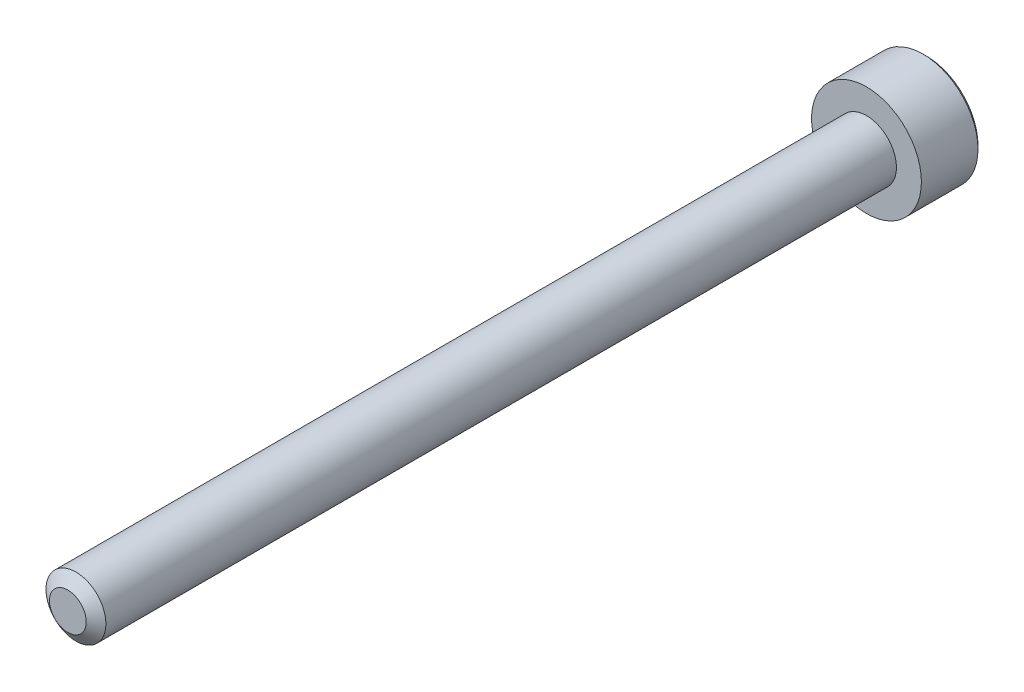
ISO-10303-21;
HEADER;
FILE_DESCRIPTION(('STEP AP214'),'2;1');
FILE_NAME('part.step','',(''),(''),'','','');
FILE_SCHEMA(('AUTOMOTIVE_DESIGN { 1 0 10303 214 1 1 1 1 }'));
ENDSEC;
DATA;
#1=APPLICATION_CONTEXT('core data for automotive mechanical design processes');
#2=APPLICATION_PROTOCOL_DEFINITION('international standard','automotive_design',2000,#1);
#3=PRODUCT_CONTEXT('',#1,'mechanical');
#4=PRODUCT('Part','Part','',(#3));
#5=PRODUCT_RELATED_PRODUCT_CATEGORY('part','',(#4));
#6=PRODUCT_DEFINITION_FORMATION('','',#4);
#7=PRODUCT_DEFINITION_CONTEXT('part definition',#1,'design');
#8=PRODUCT_DEFINITION('design','',#6,#7);
#9=PRODUCT_DEFINITION_SHAPE('','',#8);
#10=(LENGTH_UNIT() NAMED_UNIT(*) SI_UNIT(.MILLI.,.METRE.));
#11=(NAMED_UNIT(*) PLANE_ANGLE_UNIT() SI_UNIT($,.RADIAN.));
#12=(NAMED_UNIT(*) SI_UNIT($,.STERADIAN.) SOLID_ANGLE_UNIT());
#13=UNCERTAINTY_MEASURE_WITH_UNIT(LENGTH_MEASURE(1.E-05),#10,'distance_accuracy_value','');
#14=(GEOMETRIC_REPRESENTATION_CONTEXT(3) GLOBAL_UNCERTAINTY_ASSIGNED_CONTEXT((#13)) GLOBAL_UNIT_ASSIGNED_CONTEXT((#10,
#11,#12)) REPRESENTATION_CONTEXT('',''));
#15=CARTESIAN_POINT('',(0.,0.,0.));
#16=DIRECTION('',(0.,0.,1.));
#17=DIRECTION('',(1.,0.,0.));
#18=AXIS2_PLACEMENT_3D('',#15,#16,#17);
#19=CARTESIAN_POINT('',(0.,-1.44337567297406,-41.125));
#20=DIRECTION('',(-0.5,-0.866025403784439,0.));
#21=DIRECTION('',(0.866025403784439,-0.5,0.));
#22=AXIS2_PLACEMENT_3D('',#19,#20,#21);
#23=PLANE('',#22);
#24=CARTESIAN_POINT('',(-1.24999999999963,-0.721687836487239,-43.000000000003));
#25=CARTESIAN_POINT('',(-1.20703689149564,-0.746492598747242,-42.975219039721));
#26=CARTESIAN_POINT('',(-1.16335543595403,-0.771712098862788,-42.9518937494657));
#27=CARTESIAN_POINT('',(-1.07428446543638,-0.823137247668132,-42.909186138913));
#28=CARTESIAN_POINT('',(-1.02888648443507,-0.849347784219903,-42.8898275733521));
#29=CARTESIAN_POINT('',(-0.937343688522239,-0.902200042082549,-42.856666215906));
#30=CARTESIAN_POINT('',(-0.891222174141857,-0.928828310825495,-42.8427800967764));
#31=CARTESIAN_POINT('',(-0.797964038891722,-0.982670920316284,-42.8213859017929));
#32=CARTESIAN_POINT('',(-0.750830264934014,-1.00988361739869,-42.8138618619147));
#33=CARTESIAN_POINT('',(-0.669590913522165,-1.05678717880511,-42.8070728277893));
#34=CARTESIAN_POINT('',(-0.635590177984719,-1.0764175126203,-42.8060681886478));
#35=CARTESIAN_POINT('',(-0.567648554675726,-1.11564362712693,-42.8077634952143));
#36=CARTESIAN_POINT('',(-0.533707681782475,-1.13523939922838,-42.8104642592547));
#37=CARTESIAN_POINT('',(-0.466153619735967,-1.17424175513578,-42.819414248338));
#38=CARTESIAN_POINT('',(-0.432540764897634,-1.19364814592492,-42.8256667730503));
#39=CARTESIAN_POINT('',(-0.365876260757905,-1.23213691533539,-42.8413835392386));
#40=CARTESIAN_POINT('',(-0.332824858668716,-1.25121915122868,-42.8508491588515));
#41=CARTESIAN_POINT('',(-0.248213569935874,-1.30006950155507,-42.8789283315731));
#42=CARTESIAN_POINT('',(-0.197186124431756,-1.32953021095293,-42.8996493450566));
#43=CARTESIAN_POINT('',(-0.0971276056215303,-1.38729902372273,-42.9463235058126));
#44=CARTESIAN_POINT('',(-0.0480906425376808,-1.41561052755943,-42.9722596212246));
#45=CARTESIAN_POINT('',(-3.61828884321874E-13,-1.44337567297385,-43.000000000003));
#46=B_SPLINE_CURVE_WITH_KNOTS('',3,(#24,#25,#26,#27,#28,#29,#30,#31,#32,#33,#34,#35,#36,#37,#38,
#39,#40,#41,#42,#43,#44,#45),.UNSPECIFIED.,.F.,.F.,(4,2,2,2,2,2,2,2,2,2,4),(0.,0.16647868322575,
0.333926926832641,0.498716658518154,0.663091654628168,0.780745575560145,0.898425484353181,
1.01621489977196,1.13405490052613,1.32111591641517,1.50757565758526),.UNSPECIFIED.);
#47=CARTESIAN_POINT('',(-1.25000000000258,-0.721687836485538,-43.0000000000047));
#48=VERTEX_POINT('',#47);
#49=CARTESIAN_POINT('',(-2.76064978169122E-12,-1.44337567297566,-43.0000000000048));
#50=VERTEX_POINT('',#49);
#51=EDGE_CURVE('E21',#48,#50,#46,.T.);
#52=ORIENTED_EDGE('',*,*,#51,.F.);
#53=DIRECTION('',(0.,0.,1.));
#54=VECTOR('',#53,1.);
#55=CARTESIAN_POINT('',(-1.25,-0.721687836487032,-41.125));
#56=LINE('',#55,#54);
#57=CARTESIAN_POINT('',(-1.25,-0.721687836487031,-41.125));
#58=VERTEX_POINT('',#57);
#59=EDGE_CURVE('E104',#48,#58,#56,.T.);
#60=ORIENTED_EDGE('',*,*,#59,.T.);
#61=DIRECTION('',(0.866025403784439,-0.5,0.));
#62=VECTOR('',#61,1.);
#63=CARTESIAN_POINT('',(0.,-1.44337567297406,-41.125));
#64=LINE('',#63,#62);
#65=CARTESIAN_POINT('',(0.,-1.44337567297406,-41.125));
#66=VERTEX_POINT('',#65);
#67=EDGE_CURVE('E77',#66,#58,#64,.F.);
#68=ORIENTED_EDGE('',*,*,#67,.F.);
#69=DIRECTION('',(0.,0.,1.));
#70=VECTOR('',#69,1.);
#71=CARTESIAN_POINT('',(0.,-1.44337567297406,-41.125));
#72=LINE('',#71,#70);
#73=EDGE_CURVE('E76',#66,#50,#72,.F.);
#74=ORIENTED_EDGE('',*,*,#73,.T.);
#75=EDGE_LOOP('',(#52,#60,#68,#74));
#76=FACE_BOUND('',#75,.T.);
#77=ADVANCED_FACE('F17',(#76),#23,.F.);
#78=CARTESIAN_POINT('',(1.25,-0.721687836487033,-41.125));
#79=DIRECTION('',(0.5,-0.866025403784439,0.));
#80=DIRECTION('',(0.866025403784439,0.5,0.));
#81=AXIS2_PLACEMENT_3D('',#78,#79,#80);
#82=PLANE('',#81);
#83=CARTESIAN_POINT('',(3.65491355903534E-13,-1.44337567297385,-43.000000000003));
#84=CARTESIAN_POINT('',(0.042963108504357,-1.41857091071385,-42.975219039721));
#85=CARTESIAN_POINT('',(0.0866445640459731,-1.3933514105983,-42.9518937494657));
#86=CARTESIAN_POINT('',(0.175715534563619,-1.34192626179296,-42.909186138913));
#87=CARTESIAN_POINT('',(0.221113515564926,-1.31571572524119,-42.8898275733521));
#88=CARTESIAN_POINT('',(0.312656311477759,-1.26286346737855,-42.856666215906));
#89=CARTESIAN_POINT('',(0.35877782585814,-1.2362351986356,-42.8427800967764));
#90=CARTESIAN_POINT('',(0.452035961108275,-1.18239258914481,-42.8213859017929));
#91=CARTESIAN_POINT('',(0.499169735065983,-1.15517989206241,-42.8138618619147));
#92=CARTESIAN_POINT('',(0.580409086477832,-1.10827633065598,-42.8070728277893));
#93=CARTESIAN_POINT('',(0.614409822015277,-1.08864599684079,-42.8060681886478));
#94=CARTESIAN_POINT('',(0.68235144532427,-1.04941988233417,-42.8077634952143));
#95=CARTESIAN_POINT('',(0.716292318217521,-1.02982411023272,-42.8104642592547));
#96=CARTESIAN_POINT('',(0.783846380264029,-0.990821754325314,-42.819414248338));
#97=CARTESIAN_POINT('',(0.817459235102362,-0.971415363536171,-42.8256667730503));
#98=CARTESIAN_POINT('',(0.884123739242092,-0.932926594125705,-42.8413835392386));
#99=CARTESIAN_POINT('',(0.917175141331281,-0.913844358232417,-42.8508491588515));
#100=CARTESIAN_POINT('',(1.00178643006412,-0.86499400790603,-42.8789283315731));
#101=CARTESIAN_POINT('',(1.05281387556824,-0.835533298508169,-42.8996493450566));
#102=CARTESIAN_POINT('',(1.15287239437847,-0.77776448573837,-42.9463235058126));
#103=CARTESIAN_POINT('',(1.20190935746232,-0.749452981901667,-42.9722596212246));
#104=CARTESIAN_POINT('',(1.24999999999963,-0.721687836487244,-43.000000000003));
#105=B_SPLINE_CURVE_WITH_KNOTS('',3,(#83,#84,#85,#86,#87,#88,#89,#90,#91,#92,#93,#94,#95,#96,
#97,#98,#99,#100,#101,#102,#103,#104),.UNSPECIFIED.,.F.,.F.,(4,2,2,2,2,2,2,2,2,2,4),(0.,
0.166478683225751,0.333926926832639,0.498716658518151,0.663091654628164,0.780745575560141,
0.898425484353177,1.01621489977195,1.13405490052613,1.32111591641516,1.50757565758525),.UNSPECIFIED.);
#106=CARTESIAN_POINT('',(1.25,-0.721687836490222,-43.0000000000048));
#107=VERTEX_POINT('',#106);
#108=EDGE_CURVE('E84',#50,#107,#105,.T.);
#109=ORIENTED_EDGE('',*,*,#108,.F.);
#110=ORIENTED_EDGE('',*,*,#73,.F.);
#111=DIRECTION('',(-0.86602540378444,-0.499999999999997,0.));
#112=VECTOR('',#111,1.);
#113=CARTESIAN_POINT('',(1.25,-0.721687836487033,-41.125));
#114=LINE('',#113,#112);
#115=CARTESIAN_POINT('',(1.25,-0.721687836487033,-41.125));
#116=VERTEX_POINT('',#115);
#117=EDGE_CURVE('E268',#116,#66,#114,.T.);
#118=ORIENTED_EDGE('',*,*,#117,.F.);
#119=DIRECTION('',(0.,0.,-1.));
#120=VECTOR('',#119,1.);
#121=CARTESIAN_POINT('',(1.25,-0.721687836487033,-41.125));
#122=LINE('',#121,#120);
#123=EDGE_CURVE('E103',#116,#107,#122,.T.);
#124=ORIENTED_EDGE('',*,*,#123,.T.);
#125=EDGE_LOOP('',(#109,#110,#118,#124));
#126=FACE_BOUND('',#125,.T.);
#127=ADVANCED_FACE('F101',(#126),#82,.F.);
#128=CARTESIAN_POINT('',(-1.25,-0.721687836487032,-41.125));
#129=DIRECTION('',(-1.,0.,0.));
#130=DIRECTION('',(0.,-1.,0.));
#131=AXIS2_PLACEMENT_3D('',#128,#129,#130);
#132=PLANE('',#131);
#133=CARTESIAN_POINT('',(-1.25,0.72168783648661,-43.000000000003));
#134=CARTESIAN_POINT('',(-1.25,0.672078311966606,-42.975219039721));
#135=CARTESIAN_POINT('',(-1.25,0.621639311735512,-42.9518937494657));
#136=CARTESIAN_POINT('',(-1.25,0.518789014124825,-42.909186138913));
#137=CARTESIAN_POINT('',(-1.25,0.466367941021285,-42.8898275733521));
#138=CARTESIAN_POINT('',(-1.25,0.360663425295995,-42.856666215906));
#139=CARTESIAN_POINT('',(-1.25,0.307406887810102,-42.8427800967764));
#140=CARTESIAN_POINT('',(-1.25,0.199721668828528,-42.8213859017929));
#141=CARTESIAN_POINT('',(-1.25,0.145296274663717,-42.8138618619147));
#142=CARTESIAN_POINT('',(-1.25,0.0514891518508746,-42.8070728277893));
#143=CARTESIAN_POINT('',(-1.25,0.0122284842204953,-42.8060681886478));
#144=CARTESIAN_POINT('',(-1.25,-0.0662237447927591,-42.8077634952143));
#145=CARTESIAN_POINT('',(-1.25,-0.105415288995657,-42.8104642592547));
#146=CARTESIAN_POINT('',(-1.25,-0.183420000810465,-42.819414248338));
#147=CARTESIAN_POINT('',(-1.25,-0.222232782388752,-42.8256667730503));
#148=CARTESIAN_POINT('',(-1.25,-0.299210321209684,-42.8413835392386));
#149=CARTESIAN_POINT('',(-1.25,-0.33737479299626,-42.8508491588515));
#150=CARTESIAN_POINT('',(-1.25,-0.435075493649035,-42.8789283315731));
#151=CARTESIAN_POINT('',(-1.25,-0.493996912444758,-42.8996493450566));
#152=CARTESIAN_POINT('',(-1.25,-0.609534537984357,-42.9463235058126));
#153=CARTESIAN_POINT('',(-1.25,-0.666157545657763,-42.9722596212246));
#154=CARTESIAN_POINT('',(-1.25,-0.72168783648661,-43.000000000003));
#155=B_SPLINE_CURVE_WITH_KNOTS('',3,(#133,#134,#135,#136,#137,#138,#139,#140,#141,#142,#143,
#144,#145,#146,#147,#148,#149,#150,#151,#152,#153,#154),.UNSPECIFIED.,.F.,.F.,(4,2,2,2,2,2,2,2,
2,2,4),(0.,0.16647868322575,0.333926926832637,0.498716658518149,0.66309165462816,
0.780745575560138,0.898425484353173,1.01621489977195,1.13405490052612,1.32111591641516,
1.50757565758525),.UNSPECIFIED.);
#156=CARTESIAN_POINT('',(-1.25,0.721687836490011,-43.0000000000047));
#157=VERTEX_POINT('',#156);
#158=EDGE_CURVE('E61',#157,#48,#155,.T.);
#159=ORIENTED_EDGE('',*,*,#158,.F.);
#160=DIRECTION('',(0.,0.,1.));
#161=VECTOR('',#160,1.);
#162=CARTESIAN_POINT('',(-1.25,0.721687836487032,-41.125));
#163=LINE('',#162,#161);
#164=CARTESIAN_POINT('',(-1.25,0.721687836487032,-41.125));
#165=VERTEX_POINT('',#164);
#166=EDGE_CURVE('E245',#157,#165,#163,.T.);
#167=ORIENTED_EDGE('',*,*,#166,.T.);
#168=DIRECTION('',(0.,1.,0.));
#169=VECTOR('',#168,1.);
#170=CARTESIAN_POINT('',(-1.25,2.1650635094611,-41.125));
#171=LINE('',#170,#169);
#172=EDGE_CURVE('E264',#58,#165,#171,.T.);
#173=ORIENTED_EDGE('',*,*,#172,.F.);
#174=ORIENTED_EDGE('',*,*,#59,.F.);
#175=EDGE_LOOP('',(#159,#167,#173,#174));
#176=FACE_BOUND('',#175,.T.);
#177=ADVANCED_FACE('F122',(#176),#132,.F.);
#178=CARTESIAN_POINT('',(1.25,2.1650635094611,-41.125));
#179=DIRECTION('',(0.,0.,-1.));
#180=DIRECTION('',(-1.,0.,0.));
#181=AXIS2_PLACEMENT_3D('',#178,#179,#180);
#182=PLANE('',#181);
#183=ORIENTED_EDGE('',*,*,#67,.T.);
#184=ORIENTED_EDGE('',*,*,#172,.T.);
#185=DIRECTION('',(-0.866025403784439,-0.5,0.));
#186=VECTOR('',#185,1.);
#187=CARTESIAN_POINT('',(-1.25,0.721687836487032,-41.125));
#188=LINE('',#187,#186);
#189=CARTESIAN_POINT('',(0.,1.44337567297406,-41.125));
#190=VERTEX_POINT('',#189);
#191=EDGE_CURVE('E144',#165,#190,#188,.F.);
#192=ORIENTED_EDGE('',*,*,#191,.T.);
#193=DIRECTION('',(-0.866025403784439,0.5,0.));
#194=VECTOR('',#193,1.);
#195=CARTESIAN_POINT('',(0.,1.44337567297406,-41.125));
#196=LINE('',#195,#194);
#197=CARTESIAN_POINT('',(1.25,0.721687836487029,-41.125));
#198=VERTEX_POINT('',#197);
#199=EDGE_CURVE('E242',#190,#198,#196,.F.);
#200=ORIENTED_EDGE('',*,*,#199,.T.);
#201=DIRECTION('',(0.,1.,0.));
#202=VECTOR('',#201,1.);
#203=CARTESIAN_POINT('',(1.25,0.721687836487032,-41.125));
#204=LINE('',#203,#202);
#205=EDGE_CURVE('E259',#198,#116,#204,.F.);
#206=ORIENTED_EDGE('',*,*,#205,.T.);
#207=ORIENTED_EDGE('',*,*,#117,.T.);
#208=EDGE_LOOP('',(#183,#184,#192,#200,#206,#207));
#209=FACE_BOUND('',#208,.T.);
#210=ADVANCED_FACE('F126',(#209),#182,.T.);
#211=CARTESIAN_POINT('',(1.25,0.721687836487032,-41.125));
#212=DIRECTION('',(1.,0.,0.));
#213=DIRECTION('',(0.,0.,-1.));
#214=AXIS2_PLACEMENT_3D('',#211,#212,#213);
#215=PLANE('',#214);
#216=CARTESIAN_POINT('',(1.25,-0.72168783648661,-43.000000000003));
#217=CARTESIAN_POINT('',(1.25,-0.672078311966609,-42.975219039721));
#218=CARTESIAN_POINT('',(1.25,-0.621639311735518,-42.9518937494657));
#219=CARTESIAN_POINT('',(1.25,-0.518789014124834,-42.909186138913));
#220=CARTESIAN_POINT('',(1.25,-0.466367941021294,-42.8898275733521));
#221=CARTESIAN_POINT('',(1.25,-0.360663425296003,-42.856666215906));
#222=CARTESIAN_POINT('',(1.25,-0.307406887810109,-42.8427800967764));
#223=CARTESIAN_POINT('',(1.25,-0.199721668828531,-42.8213859017929));
#224=CARTESIAN_POINT('',(1.25,-0.145296274663719,-42.8138618619147));
#225=CARTESIAN_POINT('',(1.25,-0.051489151850874,-42.8070728277893));
#226=CARTESIAN_POINT('',(1.25,-0.012228484220494,-42.8060681886478));
#227=CARTESIAN_POINT('',(1.25,0.0662237447927618,-42.8077634952143));
#228=CARTESIAN_POINT('',(1.25,0.105415288995661,-42.8104642592547));
#229=CARTESIAN_POINT('',(1.25,0.183420000810469,-42.819414248338));
#230=CARTESIAN_POINT('',(1.25,0.222232782388755,-42.8256667730503));
#231=CARTESIAN_POINT('',(1.25,0.299210321209685,-42.8413835392386));
#232=CARTESIAN_POINT('',(1.25,0.33737479299626,-42.8508491588515));
#233=CARTESIAN_POINT('',(1.25,0.435075493648657,-42.878928331573));
#234=CARTESIAN_POINT('',(1.25,0.493996912444016,-42.8996493450564));
#235=CARTESIAN_POINT('',(1.25,0.609534537982913,-42.9463235058119));
#236=CARTESIAN_POINT('',(1.25,0.666157545655982,-42.9722596212237));
#237=CARTESIAN_POINT('',(1.25,0.721687836484505,-43.0000000000019));
#238=B_SPLINE_CURVE_WITH_KNOTS('',3,(#216,#217,#218,#219,#220,#221,#222,#223,#224,#225,#226,
#227,#228,#229,#230,#231,#232,#233,#234,#235,#236,#237),.UNSPECIFIED.,.F.,.F.,(4,2,2,2,2,2,2,2,
2,2,4),(0.,0.166478683225743,0.333926926832625,0.498716658518143,0.663091654628159,
0.780745575560139,0.898425484353176,1.01621489977195,1.13405490052612,1.32111591641398,
1.5075756575829),.UNSPECIFIED.);
#239=CARTESIAN_POINT('',(1.25000000000029,0.721687836488459,-43.0000000000041));
#240=VERTEX_POINT('',#239);
#241=EDGE_CURVE('E40',#107,#240,#238,.T.);
#242=ORIENTED_EDGE('',*,*,#241,.F.);
#243=ORIENTED_EDGE('',*,*,#123,.F.);
#244=ORIENTED_EDGE('',*,*,#205,.F.);
#245=DIRECTION('',(0.,0.,1.));
#246=VECTOR('',#245,1.);
#247=CARTESIAN_POINT('',(1.25,0.721687836487029,-41.125));
#248=LINE('',#247,#246);
#249=EDGE_CURVE('E238',#198,#240,#248,.F.);
#250=ORIENTED_EDGE('',*,*,#249,.T.);
#251=EDGE_LOOP('',(#242,#243,#244,#250));
#252=FACE_BOUND('',#251,.T.);
#253=ADVANCED_FACE('F130',(#252),#215,.F.);
#254=CARTESIAN_POINT('',(-1.25,0.721687836487032,-41.125));
#255=DIRECTION('',(-0.5,0.866025403784439,0.));
#256=DIRECTION('',(-0.866025403784439,-0.5,0.));
#257=AXIS2_PLACEMENT_3D('',#254,#255,#256);
#258=PLANE('',#257);
#259=CARTESIAN_POINT('',(-2.18591770066846E-12,1.4433756729728,-43.0000000000019));
#260=CARTESIAN_POINT('',(-0.0429631085060691,1.41857091071286,-42.9752190397201));
#261=CARTESIAN_POINT('',(-0.086644564047575,1.39335141059738,-42.9518937494649));
#262=CARTESIAN_POINT('',(-0.175715534564988,1.34192626179217,-42.9091861389124));
#263=CARTESIAN_POINT('',(-0.221113515566174,1.31571572524047,-42.8898275733516));
#264=CARTESIAN_POINT('',(-0.312656311478756,1.26286346737797,-42.8566662159057));
#265=CARTESIAN_POINT('',(-0.358777825859009,1.2362351986351,-42.8427800967762));
#266=CARTESIAN_POINT('',(-0.452035961108879,1.18239258914446,-42.8213859017928));
#267=CARTESIAN_POINT('',(-0.49916973506645,1.15517989206214,-42.8138618619146));
#268=CARTESIAN_POINT('',(-0.580409086478155,1.1082763306558,-42.8070728277893));
#269=CARTESIAN_POINT('',(-0.614409822015595,1.08864599684061,-42.8060681886478));
#270=CARTESIAN_POINT('',(-0.682351445324575,1.04941988233399,-42.8077634952143));
#271=CARTESIAN_POINT('',(-0.716292318217819,1.02982411023254,-42.8104642592547));
#272=CARTESIAN_POINT('',(-0.783846380264314,0.990821754325149,-42.819414248338));
#273=CARTESIAN_POINT('',(-0.81745923510264,0.971415363536009,-42.8256667730504));
#274=CARTESIAN_POINT('',(-0.884123739242356,0.932926594125552,-42.8413835392387));
#275=CARTESIAN_POINT('',(-0.917175141331538,0.913844358232268,-42.8508491588516));
#276=CARTESIAN_POINT('',(-1.00178643006433,0.86499400790591,-42.8789283315732));
#277=CARTESIAN_POINT('',(-1.0528138755684,0.835533298508073,-42.8996493450567));
#278=CARTESIAN_POINT('',(-1.15287239437855,0.777764485738322,-42.9463235058126));
#279=CARTESIAN_POINT('',(-1.20190935746236,0.749452981901643,-42.9722596212246));
#280=CARTESIAN_POINT('',(-1.24999999999963,0.721687836487243,-43.000000000003));
#281=B_SPLINE_CURVE_WITH_KNOTS('',3,(#259,#260,#261,#262,#263,#264,#265,#266,#267,#268,#269,
#270,#271,#272,#273,#274,#275,#276,#277,#278,#279,#280),.UNSPECIFIED.,.F.,.F.,(4,2,2,2,2,2,2,2,
2,2,4),(0.,0.16647868322526,0.333926926831642,0.498716658516666,0.663091654626194,
0.780745575558151,0.898425484351165,1.01621489976992,1.13405490052408,1.32111591641297,
1.5075756575829),.UNSPECIFIED.);
#282=CARTESIAN_POINT('',(-1.67429437889982E-12,1.44337567297503,-43.0000000000041));
#283=VERTEX_POINT('',#282);
#284=EDGE_CURVE('E145',#283,#157,#281,.T.);
#285=ORIENTED_EDGE('',*,*,#284,.F.);
#286=DIRECTION('',(0.,0.,1.));
#287=VECTOR('',#286,1.);
#288=CARTESIAN_POINT('',(0.,1.44337567297406,-41.125));
#289=LINE('',#288,#287);
#290=EDGE_CURVE('E170',#283,#190,#289,.T.);
#291=ORIENTED_EDGE('',*,*,#290,.T.);
#292=ORIENTED_EDGE('',*,*,#191,.F.);
#293=ORIENTED_EDGE('',*,*,#166,.F.);
#294=EDGE_LOOP('',(#285,#291,#292,#293));
#295=FACE_BOUND('',#294,.T.);
#296=ADVANCED_FACE('F135',(#295),#258,.F.);
#297=CARTESIAN_POINT('',(0.,1.44337567297406,-41.125));
#298=DIRECTION('',(0.5,0.866025403784439,0.));
#299=DIRECTION('',(-0.866025403784439,0.5,0.));
#300=AXIS2_PLACEMENT_3D('',#297,#298,#299);
#301=PLANE('',#300);
#302=CARTESIAN_POINT('',(2.18308492987564E-12,1.4433756729728,-43.0000000000019));
#303=CARTESIAN_POINT('',(0.0429631085060646,1.41857091071286,-42.9752190397201));
#304=CARTESIAN_POINT('',(0.0866445640475686,1.39335141059738,-42.9518937494649));
#305=CARTESIAN_POINT('',(0.175715534564978,1.34192626179217,-42.9091861389124));
#306=CARTESIAN_POINT('',(0.221113515566162,1.31571572524047,-42.8898275733516));
#307=CARTESIAN_POINT('',(0.312656311478745,1.26286346737797,-42.8566662159057));
#308=CARTESIAN_POINT('',(0.358777825859,1.2362351986351,-42.8427800967762));
#309=CARTESIAN_POINT('',(0.452035961108874,1.18239258914446,-42.8213859017928));
#310=CARTESIAN_POINT('',(0.499169735066448,1.15517989206213,-42.8138618619146));
#311=CARTESIAN_POINT('',(0.580409086478155,1.10827633065579,-42.8070728277893));
#312=CARTESIAN_POINT('',(0.614409822015596,1.08864599684061,-42.8060681886478));
#313=CARTESIAN_POINT('',(0.682351445324577,1.04941988233399,-42.8077634952143));
#314=CARTESIAN_POINT('',(0.716292318217822,1.02982411023254,-42.8104642592547));
#315=CARTESIAN_POINT('',(0.783846380264316,0.990821754325144,-42.819414248338));
#316=CARTESIAN_POINT('',(0.817459235102642,0.971415363536004,-42.8256667730504));
#317=CARTESIAN_POINT('',(0.884123739242357,0.932926594125547,-42.8413835392387));
#318=CARTESIAN_POINT('',(0.917175141331538,0.913844358232264,-42.8508491588516));
#319=CARTESIAN_POINT('',(1.001786430064,0.864994007906095,-42.8789283315731));
#320=CARTESIAN_POINT('',(1.05281387556776,0.835533298508441,-42.8996493450564));
#321=CARTESIAN_POINT('',(1.15287239437729,0.777764485739041,-42.946323505812));
#322=CARTESIAN_POINT('',(1.20190935746081,0.749452981902531,-42.9722596212238));
#323=CARTESIAN_POINT('',(1.24999999999781,0.721687836488291,-43.0000000000019));
#324=B_SPLINE_CURVE_WITH_KNOTS('',3,(#302,#303,#304,#305,#306,#307,#308,#309,#310,#311,#312,
#313,#314,#315,#316,#317,#318,#319,#320,#321,#322,#323),.UNSPECIFIED.,.F.,.F.,(4,2,2,2,2,2,2,2,
2,2,4),(0.,0.166478683225254,0.333926926831631,0.498716658516661,0.663091654626198,
0.780745575558156,0.898425484351172,1.01621489976993,1.13405490052408,1.32111591641179,
1.50757565758056),.UNSPECIFIED.);
#325=EDGE_CURVE('E162',#283,#240,#324,.T.);
#326=ORIENTED_EDGE('',*,*,#325,.T.);
#327=ORIENTED_EDGE('',*,*,#249,.F.);
#328=ORIENTED_EDGE('',*,*,#199,.F.);
#329=ORIENTED_EDGE('',*,*,#290,.F.);
#330=EDGE_LOOP('',(#326,#327,#328,#329));
#331=FACE_BOUND('',#330,.T.);
#332=ADVANCED_FACE('F172',(#331),#301,.F.);
#333=CARTESIAN_POINT('',(0.,0.,-42.9999999998927));
#334=DIRECTION('',(0.,0.,-1.));
#335=DIRECTION('',(-1.,0.,0.));
#336=AXIS2_PLACEMENT_3D('',#333,#334,#335);
#337=CONICAL_SURFACE('',#336,1.44337567286357,0.785398163397448);
#338=ORIENTED_EDGE('',*,*,#284,.T.);
#339=CARTESIAN_POINT('',(0.,0.,-43.0000000000064));
#340=DIRECTION('',(0.,0.,-1.));
#341=DIRECTION('',(-1.,0.,0.));
#342=AXIS2_PLACEMENT_3D('',#339,#340,#341);
#343=CIRCLE('',#342,1.44337567297725);
#344=EDGE_CURVE('E169',#283,#157,#343,.F.);
#345=ORIENTED_EDGE('',*,*,#344,.F.);
#346=EDGE_LOOP('',(#338,#345));
#347=FACE_BOUND('',#346,.T.);
#348=ADVANCED_FACE('F175',(#347),#337,.F.);
#349=CARTESIAN_POINT('',(0.,0.,-42.9999999998927));
#350=DIRECTION('',(0.,0.,-1.));
#351=DIRECTION('',(-1.,0.,0.));
#352=AXIS2_PLACEMENT_3D('',#349,#350,#351);
#353=CONICAL_SURFACE('',#352,1.44337567286357,0.785398163397448);
#354=CARTESIAN_POINT('',(0.,0.,-43.0000000000064));
#355=DIRECTION('',(0.,0.,-1.));
#356=DIRECTION('',(-1.,0.,0.));
#357=AXIS2_PLACEMENT_3D('',#354,#355,#356);
#358=CIRCLE('',#357,1.44337567297725);
#359=EDGE_CURVE('E94',#157,#48,#358,.F.);
#360=ORIENTED_EDGE('',*,*,#359,.F.);
#361=ORIENTED_EDGE('',*,*,#158,.T.);
#362=EDGE_LOOP('',(#360,#361));
#363=FACE_BOUND('',#362,.T.);
#364=ADVANCED_FACE('F179',(#363),#353,.F.);
#365=CARTESIAN_POINT('',(0.,0.,-42.9999999998927));
#366=DIRECTION('',(0.,0.,-1.));
#367=DIRECTION('',(-1.,0.,0.));
#368=AXIS2_PLACEMENT_3D('',#365,#366,#367);
#369=CONICAL_SURFACE('',#368,1.44337567286357,0.785398163397448);
#370=ORIENTED_EDGE('',*,*,#51,.T.);
#371=CARTESIAN_POINT('',(0.,0.,-43.0000000000064));
#372=DIRECTION('',(0.,0.,-1.));
#373=DIRECTION('',(-1.,0.,0.));
#374=AXIS2_PLACEMENT_3D('',#371,#372,#373);
#375=CIRCLE('',#374,1.44337567297725);
#376=EDGE_CURVE('E72',#48,#50,#375,.F.);
#377=ORIENTED_EDGE('',*,*,#376,.F.);
#378=EDGE_LOOP('',(#370,#377));
#379=FACE_BOUND('',#378,.T.);
#380=ADVANCED_FACE('F70',(#379),#369,.F.);
#381=CARTESIAN_POINT('',(0.,0.,-42.9999999998927));
#382=DIRECTION('',(0.,0.,-1.));
#383=DIRECTION('',(-1.,0.,0.));
#384=AXIS2_PLACEMENT_3D('',#381,#382,#383);
#385=CONICAL_SURFACE('',#384,1.44337567286357,0.785398163397448);
#386=ORIENTED_EDGE('',*,*,#108,.T.);
#387=CARTESIAN_POINT('',(0.,0.,-43.0000000000064));
#388=DIRECTION('',(0.,0.,-1.));
#389=DIRECTION('',(-1.,0.,0.));
#390=AXIS2_PLACEMENT_3D('',#387,#388,#389);
#391=CIRCLE('',#390,1.44337567297725);
#392=EDGE_CURVE('E92',#50,#107,#391,.F.);
#393=ORIENTED_EDGE('',*,*,#392,.F.);
#394=EDGE_LOOP('',(#386,#393));
#395=FACE_BOUND('',#394,.T.);
#396=ADVANCED_FACE('F97',(#395),#385,.F.);
#397=CARTESIAN_POINT('',(0.,0.,-42.9999999998927));
#398=DIRECTION('',(0.,0.,-1.));
#399=DIRECTION('',(-1.,0.,0.));
#400=AXIS2_PLACEMENT_3D('',#397,#398,#399);
#401=CONICAL_SURFACE('',#400,1.44337567286357,0.785398163397448);
#402=ORIENTED_EDGE('',*,*,#241,.T.);
#403=CARTESIAN_POINT('',(0.,0.,-43.0000000000064));
#404=DIRECTION('',(0.,0.,-1.));
#405=DIRECTION('',(-1.,0.,0.));
#406=AXIS2_PLACEMENT_3D('',#403,#404,#405);
#407=CIRCLE('',#406,1.44337567297725);
#408=EDGE_CURVE('E99',#107,#240,#407,.F.);
#409=ORIENTED_EDGE('',*,*,#408,.F.);
#410=EDGE_LOOP('',(#402,#409));
#411=FACE_BOUND('',#410,.T.);
#412=ADVANCED_FACE('F152',(#411),#401,.F.);
#413=CARTESIAN_POINT('',(0.,0.,-42.9999999998927));
#414=DIRECTION('',(0.,0.,-1.));
#415=DIRECTION('',(-1.,0.,0.));
#416=AXIS2_PLACEMENT_3D('',#413,#414,#415);
#417=CONICAL_SURFACE('',#416,1.44337567286357,0.785398163397448);
#418=ORIENTED_EDGE('',*,*,#325,.F.);
#419=CARTESIAN_POINT('',(0.,0.,-43.0000000000064));
#420=DIRECTION('',(0.,0.,-1.));
#421=DIRECTION('',(-1.,0.,0.));
#422=AXIS2_PLACEMENT_3D('',#419,#420,#421);
#423=CIRCLE('',#422,1.44337567297725);
#424=EDGE_CURVE('E230',#240,#283,#423,.F.);
#425=ORIENTED_EDGE('',*,*,#424,.F.);
#426=EDGE_LOOP('',(#418,#425));
#427=FACE_BOUND('',#426,.T.);
#428=ADVANCED_FACE('F156',(#427),#417,.F.);
#429=CARTESIAN_POINT('',(0.,0.,-43.));
#430=DIRECTION('',(0.,0.,-1.));
#431=DIRECTION('',(-1.,0.,0.));
#432=AXIS2_PLACEMENT_3D('',#429,#430,#431);
#433=PLANE('',#432);
#434=ORIENTED_EDGE('',*,*,#408,.T.);
#435=ORIENTED_EDGE('',*,*,#424,.T.);
#436=ORIENTED_EDGE('',*,*,#344,.T.);
#437=ORIENTED_EDGE('',*,*,#359,.T.);
#438=ORIENTED_EDGE('',*,*,#376,.T.);
#439=ORIENTED_EDGE('',*,*,#392,.T.);
#440=EDGE_LOOP('',(#434,#435,#436,#437,#438,#439));
#441=FACE_BOUND('',#440,.T.);
#442=CARTESIAN_POINT('',(0.,0.,-43.0000000000064));
#443=DIRECTION('',(0.,0.,1.));
#444=DIRECTION('',(1.,0.,0.));
#445=AXIS2_PLACEMENT_3D('',#442,#443,#444);
#446=CIRCLE('',#445,2.58500000006734);
#447=CARTESIAN_POINT('',(2.58500000006734,0.,-43.0000000000064));
#448=VERTEX_POINT('',#447);
#449=EDGE_CURVE('E221',#448,#448,#446,.T.);
#450=ORIENTED_EDGE('',*,*,#449,.F.);
#451=EDGE_LOOP('',(#450));
#452=FACE_BOUND('',#451,.T.);
#453=ADVANCED_FACE('F90',(#441,#452),#433,.T.);
#454=CARTESIAN_POINT('',(0.,0.,-42.835000000025));
#455=DIRECTION('',(0.,0.,1.));
#456=DIRECTION('',(1.,0.,0.));
#457=AXIS2_PLACEMENT_3D('',#454,#455,#456);
#458=CONICAL_SURFACE('',#457,2.75000000004866,0.785398163397448);
#459=ORIENTED_EDGE('',*,*,#449,.T.);
#460=EDGE_LOOP('',(#459));
#461=FACE_BOUND('',#460,.T.);
#462=CARTESIAN_POINT('',(0.,0.,-42.835));
#463=DIRECTION('',(0.,0.,1.));
#464=DIRECTION('',(1.,0.,0.));
#465=AXIS2_PLACEMENT_3D('',#462,#463,#464);
#466=CIRCLE('',#465,2.75);
#467=CARTESIAN_POINT('',(2.75,0.,-42.835));
#468=VERTEX_POINT('',#467);
#469=EDGE_CURVE('E224',#468,#468,#466,.T.);
#470=ORIENTED_EDGE('',*,*,#469,.F.);
#471=EDGE_LOOP('',(#470));
#472=FACE_BOUND('',#471,.T.);
#473=ADVANCED_FACE('F211',(#461,#472),#458,.T.);
#474=CARTESIAN_POINT('',(0.,0.,0.));
#475=DIRECTION('',(0.,0.,1.));
#476=DIRECTION('',(1.,0.,0.));
#477=AXIS2_PLACEMENT_3D('',#474,#475,#476);
#478=PLANE('',#477);
#479=CARTESIAN_POINT('',(0.,0.,5.6843418860808E-11));
#480=DIRECTION('',(0.,0.,-1.));
#481=DIRECTION('',(-1.,0.,0.));
#482=AXIS2_PLACEMENT_3D('',#479,#480,#481);
#483=CIRCLE('',#482,0.921240473587659);
#484=CARTESIAN_POINT('',(-0.921240473587659,0.,5.6843418860808E-11));
#485=VERTEX_POINT('',#484);
#486=EDGE_CURVE('E225',#485,#485,#483,.T.);
#487=ORIENTED_EDGE('',*,*,#486,.F.);
#488=EDGE_LOOP('',(#487));
#489=FACE_BOUND('',#488,.T.);
#490=ADVANCED_FACE('F208',(#489),#478,.T.);
#491=CARTESIAN_POINT('',(0.,0.,-43.));
#492=DIRECTION('',(0.,0.,1.));
#493=DIRECTION('',(1.,0.,0.));
#494=AXIS2_PLACEMENT_3D('',#491,#492,#493);
#495=CYLINDRICAL_SURFACE('',#494,2.75);
#496=ORIENTED_EDGE('',*,*,#469,.T.);
#497=EDGE_LOOP('',(#496));
#498=FACE_BOUND('',#497,.T.);
#499=CARTESIAN_POINT('',(0.,0.,-40.));
#500=DIRECTION('',(0.,0.,1.));
#501=DIRECTION('',(1.,0.,0.));
#502=AXIS2_PLACEMENT_3D('',#499,#500,#501);
#503=CIRCLE('',#502,2.75);
#504=CARTESIAN_POINT('',(2.75,0.,-40.));
#505=VERTEX_POINT('',#504);
#506=EDGE_CURVE('E228',#505,#505,#503,.F.);
#507=ORIENTED_EDGE('',*,*,#506,.T.);
#508=EDGE_LOOP('',(#507));
#509=FACE_BOUND('',#508,.T.);
#510=ADVANCED_FACE('F204',(#498,#509),#495,.T.);
#511=CARTESIAN_POINT('',(0.,0.,-0.405251783149652));
#512=DIRECTION('',(0.,0.,-1.));
#513=DIRECTION('',(-1.,0.,0.));
#514=AXIS2_PLACEMENT_3D('',#511,#512,#513);
#515=CONICAL_SURFACE('',#514,1.50000000002137,0.959931088612039);
#516=ORIENTED_EDGE('',*,*,#486,.T.);
#517=EDGE_LOOP('',(#516));
#518=FACE_BOUND('',#517,.T.);
#519=CARTESIAN_POINT('',(0.,0.,-0.405251783209382));
#520=DIRECTION('',(0.,0.,1.));
#521=DIRECTION('',(1.,0.,0.));
#522=AXIS2_PLACEMENT_3D('',#519,#520,#521);
#523=CIRCLE('',#522,1.5);
#524=CARTESIAN_POINT('',(1.5,0.,-0.405251783209382));
#525=VERTEX_POINT('',#524);
#526=EDGE_CURVE('E32',#525,#525,#523,.F.);
#527=ORIENTED_EDGE('',*,*,#526,.F.);
#528=EDGE_LOOP('',(#527));
#529=FACE_BOUND('',#528,.T.);
#530=ADVANCED_FACE('F197',(#518,#529),#515,.T.);
#531=CARTESIAN_POINT('',(0.,0.,-40.));
#532=DIRECTION('',(0.,0.,-1.));
#533=DIRECTION('',(-1.,0.,0.));
#534=AXIS2_PLACEMENT_3D('',#531,#532,#533);
#535=PLANE('',#534);
#536=CARTESIAN_POINT('',(0.,0.,-40.));
#537=DIRECTION('',(0.,0.,1.));
#538=DIRECTION('',(1.,0.,0.));
#539=AXIS2_PLACEMENT_3D('',#536,#537,#538);
#540=CIRCLE('',#539,1.5);
#541=CARTESIAN_POINT('',(1.5,0.,-40.));
#542=VERTEX_POINT('',#541);
#543=EDGE_CURVE('E11',#542,#542,#540,.T.);
#544=ORIENTED_EDGE('',*,*,#543,.F.);
#545=EDGE_LOOP('',(#544));
#546=FACE_BOUND('',#545,.T.);
#547=ORIENTED_EDGE('',*,*,#506,.F.);
#548=EDGE_LOOP('',(#547));
#549=FACE_BOUND('',#548,.T.);
#550=ADVANCED_FACE('F191',(#546,#549),#535,.F.);
#551=CARTESIAN_POINT('',(0.,0.,-40.));
#552=DIRECTION('',(0.,0.,1.));
#553=DIRECTION('',(1.,0.,0.));
#554=AXIS2_PLACEMENT_3D('',#551,#552,#553);
#555=CYLINDRICAL_SURFACE('',#554,1.5);
#556=ORIENTED_EDGE('',*,*,#543,.T.);
#557=EDGE_LOOP('',(#556));
#558=FACE_BOUND('',#557,.T.);
#559=ORIENTED_EDGE('',*,*,#526,.T.);
#560=EDGE_LOOP('',(#559));
#561=FACE_BOUND('',#560,.T.);
#562=ADVANCED_FACE('F189',(#558,#561),#555,.T.);
#563=CLOSED_SHELL('',(#77,#127,#177,#210,#253,#296,#332,#348,#364,#380,#396,#412,#428,#453,#473,
#490,#510,#530,#550,#562));
#564=MANIFOLD_SOLID_BREP('B1',#563);
#565=ADVANCED_BREP_SHAPE_REPRESENTATION('',(#18,#564),#14);
#566=SHAPE_DEFINITION_REPRESENTATION(#9,#565);
ENDSEC;
END-ISO-10303-21;
